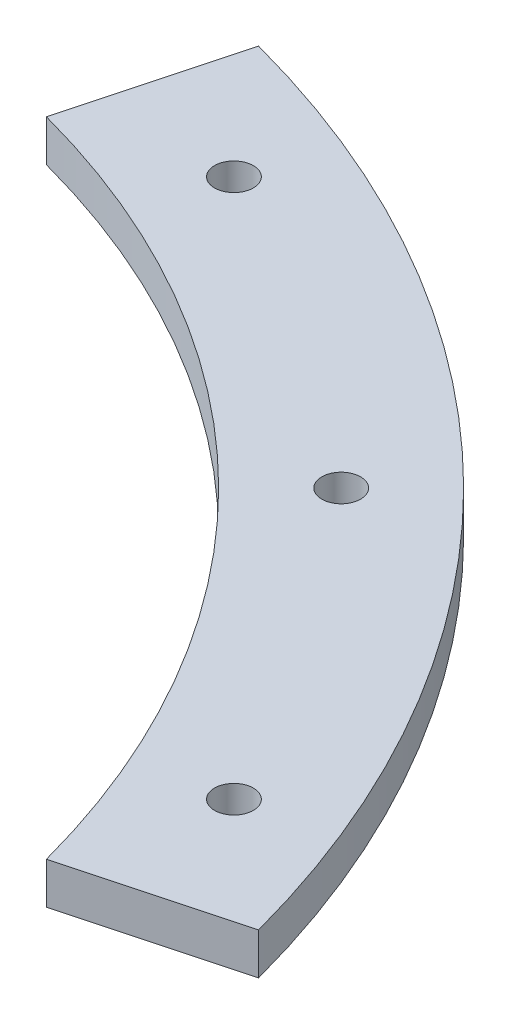
ISO-10303-21;
HEADER;
FILE_DESCRIPTION(('STEP AP214'),'2;1');
FILE_NAME('part.step','',(''),(''),'','','');
FILE_SCHEMA(('AUTOMOTIVE_DESIGN { 1 0 10303 214 1 1 1 1 }'));
ENDSEC;
DATA;
#1=APPLICATION_CONTEXT('core data for automotive mechanical design processes');
#2=APPLICATION_PROTOCOL_DEFINITION('international standard','automotive_design',2000,#1);
#3=PRODUCT_CONTEXT('',#1,'mechanical');
#4=PRODUCT('Part','Part','',(#3));
#5=PRODUCT_RELATED_PRODUCT_CATEGORY('part','',(#4));
#6=PRODUCT_DEFINITION_FORMATION('','',#4);
#7=PRODUCT_DEFINITION_CONTEXT('part definition',#1,'design');
#8=PRODUCT_DEFINITION('design','',#6,#7);
#9=PRODUCT_DEFINITION_SHAPE('','',#8);
#10=(LENGTH_UNIT() NAMED_UNIT(*) SI_UNIT(.MILLI.,.METRE.));
#11=(NAMED_UNIT(*) PLANE_ANGLE_UNIT() SI_UNIT($,.RADIAN.));
#12=(NAMED_UNIT(*) SI_UNIT($,.STERADIAN.) SOLID_ANGLE_UNIT());
#13=UNCERTAINTY_MEASURE_WITH_UNIT(LENGTH_MEASURE(1.E-05),#10,'distance_accuracy_value','');
#14=(GEOMETRIC_REPRESENTATION_CONTEXT(3) GLOBAL_UNCERTAINTY_ASSIGNED_CONTEXT((#13)) GLOBAL_UNIT_ASSIGNED_CONTEXT((#10,
#11,#12)) REPRESENTATION_CONTEXT('',''));
#15=CARTESIAN_POINT('',(0.,0.,0.));
#16=DIRECTION('',(0.,0.,1.));
#17=DIRECTION('',(1.,0.,0.));
#18=AXIS2_PLACEMENT_3D('',#15,#16,#17);
#19=CARTESIAN_POINT('',(0.,3.048,0.));
#20=DIRECTION('',(0.,-1.,0.));
#21=DIRECTION('',(0.,0.,-1.));
#22=AXIS2_PLACEMENT_3D('',#19,#20,#21);
#23=CYLINDRICAL_SURFACE('',#22,66.675);
#24=CARTESIAN_POINT('',(0.,0.,0.));
#25=DIRECTION('',(0.,1.,0.));
#26=DIRECTION('',(0.,0.,1.));
#27=AXIS2_PLACEMENT_3D('',#24,#25,#26);
#28=CIRCLE('',#27,66.675);
#29=CARTESIAN_POINT('',(64.4031044678236,0.,-17.2567598322105));
#30=VERTEX_POINT('',#29);
#31=CARTESIAN_POINT('',(17.2567598322109,0.,-64.4031044678235));
#32=VERTEX_POINT('',#31);
#33=EDGE_CURVE('E105',#30,#32,#28,.T.);
#34=ORIENTED_EDGE('',*,*,#33,.F.);
#35=DIRECTION('',(0.,-1.,0.));
#36=VECTOR('',#35,1.);
#37=CARTESIAN_POINT('',(64.4031044678236,3.048,-17.2567598322105));
#38=LINE('',#37,#36);
#39=CARTESIAN_POINT('',(64.4031044678236,3.048,-17.2567598322105));
#40=VERTEX_POINT('',#39);
#41=EDGE_CURVE('E11',#40,#30,#38,.T.);
#42=ORIENTED_EDGE('',*,*,#41,.F.);
#43=CARTESIAN_POINT('',(0.,3.048,0.));
#44=DIRECTION('',(0.,1.,0.));
#45=DIRECTION('',(0.,0.,1.));
#46=AXIS2_PLACEMENT_3D('',#43,#44,#45);
#47=CIRCLE('',#46,66.675);
#48=CARTESIAN_POINT('',(17.2567598322109,3.048,-64.4031044678235));
#49=VERTEX_POINT('',#48);
#50=EDGE_CURVE('E91',#40,#49,#47,.T.);
#51=ORIENTED_EDGE('',*,*,#50,.T.);
#52=DIRECTION('',(0.,-1.,0.));
#53=VECTOR('',#52,1.);
#54=CARTESIAN_POINT('',(17.2567598322109,3.048,-64.4031044678235));
#55=LINE('',#54,#53);
#56=EDGE_CURVE('E73',#49,#32,#55,.T.);
#57=ORIENTED_EDGE('',*,*,#56,.T.);
#58=EDGE_LOOP('',(#34,#42,#51,#57));
#59=FACE_BOUND('',#58,.T.);
#60=ADVANCED_FACE('F34',(#59),#23,.F.);
#61=CARTESIAN_POINT('',(0.,3.048,0.));
#62=DIRECTION('',(-0.25881904510252,0.,-0.965925826289069));
#63=DIRECTION('',(-0.965925826289069,0.,0.25881904510252));
#64=AXIS2_PLACEMENT_3D('',#61,#62,#63);
#65=PLANE('',#64);
#66=DIRECTION('',(0.965925826289069,0.,-0.25881904510252));
#67=VECTOR('',#66,1.);
#68=CARTESIAN_POINT('',(0.,0.,0.));
#69=LINE('',#68,#67);
#70=CARTESIAN_POINT('',(76.6703624616948,0.,-20.5437617050125));
#71=VERTEX_POINT('',#70);
#72=EDGE_CURVE('E96',#30,#71,#69,.T.);
#73=ORIENTED_EDGE('',*,*,#72,.T.);
#74=DIRECTION('',(0.,-1.,0.));
#75=VECTOR('',#74,1.);
#76=CARTESIAN_POINT('',(76.6703624616948,3.048,-20.5437617050125));
#77=LINE('',#76,#75);
#78=CARTESIAN_POINT('',(76.6703624616948,3.048,-20.5437617050125));
#79=VERTEX_POINT('',#78);
#80=EDGE_CURVE('E43',#79,#71,#77,.T.);
#81=ORIENTED_EDGE('',*,*,#80,.F.);
#82=DIRECTION('',(0.965925826289069,0.,-0.25881904510252));
#83=VECTOR('',#82,1.);
#84=CARTESIAN_POINT('',(0.,3.048,0.));
#85=LINE('',#84,#83);
#86=EDGE_CURVE('E88',#40,#79,#85,.T.);
#87=ORIENTED_EDGE('',*,*,#86,.F.);
#88=ORIENTED_EDGE('',*,*,#41,.T.);
#89=EDGE_LOOP('',(#73,#81,#87,#88));
#90=FACE_BOUND('',#89,.T.);
#91=ADVANCED_FACE('F94',(#90),#65,.F.);
#92=CARTESIAN_POINT('',(0.,3.048,0.));
#93=DIRECTION('',(0.,-1.,0.));
#94=DIRECTION('',(0.,0.,-1.));
#95=AXIS2_PLACEMENT_3D('',#92,#93,#94);
#96=CYLINDRICAL_SURFACE('',#95,79.375);
#97=CARTESIAN_POINT('',(0.,0.,0.));
#98=DIRECTION('',(0.,1.,0.));
#99=DIRECTION('',(0.,0.,1.));
#100=AXIS2_PLACEMENT_3D('',#97,#98,#99);
#101=CIRCLE('',#100,79.375);
#102=CARTESIAN_POINT('',(20.543761705013,0.,-76.6703624616947));
#103=VERTEX_POINT('',#102);
#104=EDGE_CURVE('E102',#71,#103,#101,.T.);
#105=ORIENTED_EDGE('',*,*,#104,.T.);
#106=DIRECTION('',(0.,-1.,0.));
#107=VECTOR('',#106,1.);
#108=CARTESIAN_POINT('',(20.543761705013,3.048,-76.6703624616947));
#109=LINE('',#108,#107);
#110=CARTESIAN_POINT('',(20.543761705013,3.048,-76.6703624616947));
#111=VERTEX_POINT('',#110);
#112=EDGE_CURVE('E87',#111,#103,#109,.T.);
#113=ORIENTED_EDGE('',*,*,#112,.F.);
#114=CARTESIAN_POINT('',(0.,3.048,0.));
#115=DIRECTION('',(0.,1.,0.));
#116=DIRECTION('',(0.,0.,1.));
#117=AXIS2_PLACEMENT_3D('',#114,#115,#116);
#118=CIRCLE('',#117,79.375);
#119=EDGE_CURVE('E81',#79,#111,#118,.T.);
#120=ORIENTED_EDGE('',*,*,#119,.F.);
#121=ORIENTED_EDGE('',*,*,#80,.T.);
#122=EDGE_LOOP('',(#105,#113,#120,#121));
#123=FACE_BOUND('',#122,.T.);
#124=ADVANCED_FACE('F84',(#123),#96,.T.);
#125=CARTESIAN_POINT('',(27.9454576484607,3.048,-67.4663028616367));
#126=DIRECTION('',(0.,-1.,0.));
#127=DIRECTION('',(0.,0.,-1.));
#128=AXIS2_PLACEMENT_3D('',#125,#126,#127);
#129=CYLINDRICAL_SURFACE('',#128,1.42240000000009);
#130=CARTESIAN_POINT('',(27.9454576484607,3.048,-67.4663028616367));
#131=DIRECTION('',(0.,1.,0.));
#132=DIRECTION('',(0.,0.,1.));
#133=AXIS2_PLACEMENT_3D('',#130,#131,#132);
#134=CIRCLE('',#133,1.42240000000009);
#135=CARTESIAN_POINT('',(27.9454576484607,3.048,-66.0439028616366));
#136=VERTEX_POINT('',#135);
#137=EDGE_CURVE('E118',#136,#136,#134,.T.);
#138=ORIENTED_EDGE('',*,*,#137,.T.);
#139=EDGE_LOOP('',(#138));
#140=FACE_BOUND('',#139,.T.);
#141=CARTESIAN_POINT('',(27.9454576484607,0.,-67.4663028616367));
#142=DIRECTION('',(0.,1.,0.));
#143=DIRECTION('',(0.,0.,1.));
#144=AXIS2_PLACEMENT_3D('',#141,#142,#143);
#145=CIRCLE('',#144,1.42240000000009);
#146=CARTESIAN_POINT('',(27.9454576484607,0.,-66.0439028616366));
#147=VERTEX_POINT('',#146);
#148=EDGE_CURVE('E107',#147,#147,#145,.T.);
#149=ORIENTED_EDGE('',*,*,#148,.F.);
#150=EDGE_LOOP('',(#149));
#151=FACE_BOUND('',#150,.T.);
#152=ADVANCED_FACE('F138',(#140,#151),#129,.F.);
#153=CARTESIAN_POINT('',(51.6364726961476,3.048,-51.6364726961476));
#154=DIRECTION('',(0.,-1.,0.));
#155=DIRECTION('',(0.,0.,-1.));
#156=AXIS2_PLACEMENT_3D('',#153,#154,#155);
#157=CYLINDRICAL_SURFACE('',#156,1.42240000000013);
#158=CARTESIAN_POINT('',(51.6364726961476,3.048,-51.6364726961476));
#159=DIRECTION('',(0.,1.,0.));
#160=DIRECTION('',(0.,0.,1.));
#161=AXIS2_PLACEMENT_3D('',#158,#159,#160);
#162=CIRCLE('',#161,1.42240000000013);
#163=CARTESIAN_POINT('',(51.6364726961476,3.048,-50.2140726961475));
#164=VERTEX_POINT('',#163);
#165=EDGE_CURVE('E121',#164,#164,#162,.T.);
#166=ORIENTED_EDGE('',*,*,#165,.T.);
#167=EDGE_LOOP('',(#166));
#168=FACE_BOUND('',#167,.T.);
#169=CARTESIAN_POINT('',(51.6364726961476,0.,-51.6364726961476));
#170=DIRECTION('',(0.,1.,0.));
#171=DIRECTION('',(0.,0.,1.));
#172=AXIS2_PLACEMENT_3D('',#169,#170,#171);
#173=CIRCLE('',#172,1.42240000000013);
#174=CARTESIAN_POINT('',(51.6364726961476,0.,-50.2140726961475));
#175=VERTEX_POINT('',#174);
#176=EDGE_CURVE('E110',#175,#175,#173,.T.);
#177=ORIENTED_EDGE('',*,*,#176,.F.);
#178=EDGE_LOOP('',(#177));
#179=FACE_BOUND('',#178,.T.);
#180=ADVANCED_FACE('F141',(#168,#179),#157,.F.);
#181=CARTESIAN_POINT('',(67.4663028616367,3.048,-27.9454576484607));
#182=DIRECTION('',(0.,-1.,0.));
#183=DIRECTION('',(0.,0.,-1.));
#184=AXIS2_PLACEMENT_3D('',#181,#182,#183);
#185=CYLINDRICAL_SURFACE('',#184,1.42240000000018);
#186=CARTESIAN_POINT('',(67.4663028616367,3.048,-27.9454576484607));
#187=DIRECTION('',(0.,1.,0.));
#188=DIRECTION('',(0.,0.,1.));
#189=AXIS2_PLACEMENT_3D('',#186,#187,#188);
#190=CIRCLE('',#189,1.42240000000018);
#191=CARTESIAN_POINT('',(67.4663028616367,3.048,-26.5230576484605));
#192=VERTEX_POINT('',#191);
#193=EDGE_CURVE('E101',#192,#192,#190,.T.);
#194=ORIENTED_EDGE('',*,*,#193,.T.);
#195=EDGE_LOOP('',(#194));
#196=FACE_BOUND('',#195,.T.);
#197=CARTESIAN_POINT('',(67.4663028616367,0.,-27.9454576484607));
#198=DIRECTION('',(0.,1.,0.));
#199=DIRECTION('',(0.,0.,1.));
#200=AXIS2_PLACEMENT_3D('',#197,#198,#199);
#201=CIRCLE('',#200,1.42240000000018);
#202=CARTESIAN_POINT('',(67.4663028616367,0.,-26.5230576484605));
#203=VERTEX_POINT('',#202);
#204=EDGE_CURVE('E113',#203,#203,#201,.T.);
#205=ORIENTED_EDGE('',*,*,#204,.F.);
#206=EDGE_LOOP('',(#205));
#207=FACE_BOUND('',#206,.T.);
#208=ADVANCED_FACE('F36',(#196,#207),#185,.F.);
#209=CARTESIAN_POINT('',(0.,3.048,0.));
#210=DIRECTION('',(0.965925826289067,0.,0.258819045102526));
#211=DIRECTION('',(0.258819045102526,0.,-0.965925826289067));
#212=AXIS2_PLACEMENT_3D('',#209,#210,#211);
#213=PLANE('',#212);
#214=DIRECTION('',(-0.258819045102526,0.,0.965925826289067));
#215=VECTOR('',#214,1.);
#216=CARTESIAN_POINT('',(0.,0.,0.));
#217=LINE('',#216,#215);
#218=EDGE_CURVE('E66',#103,#32,#217,.T.);
#219=ORIENTED_EDGE('',*,*,#218,.T.);
#220=ORIENTED_EDGE('',*,*,#56,.F.);
#221=DIRECTION('',(-0.258819045102526,0.,0.965925826289067));
#222=VECTOR('',#221,1.);
#223=CARTESIAN_POINT('',(0.,3.048,0.));
#224=LINE('',#223,#222);
#225=EDGE_CURVE('E51',#111,#49,#224,.T.);
#226=ORIENTED_EDGE('',*,*,#225,.F.);
#227=ORIENTED_EDGE('',*,*,#112,.T.);
#228=EDGE_LOOP('',(#219,#220,#226,#227));
#229=FACE_BOUND('',#228,.T.);
#230=ADVANCED_FACE('F132',(#229),#213,.F.);
#231=CARTESIAN_POINT('',(0.,3.048,0.));
#232=DIRECTION('',(0.,1.,0.));
#233=DIRECTION('',(0.,0.,1.));
#234=AXIS2_PLACEMENT_3D('',#231,#232,#233);
#235=PLANE('',#234);
#236=ORIENTED_EDGE('',*,*,#193,.F.);
#237=EDGE_LOOP('',(#236));
#238=FACE_BOUND('',#237,.T.);
#239=ORIENTED_EDGE('',*,*,#165,.F.);
#240=EDGE_LOOP('',(#239));
#241=FACE_BOUND('',#240,.T.);
#242=ORIENTED_EDGE('',*,*,#137,.F.);
#243=EDGE_LOOP('',(#242));
#244=FACE_BOUND('',#243,.T.);
#245=ORIENTED_EDGE('',*,*,#50,.F.);
#246=ORIENTED_EDGE('',*,*,#86,.T.);
#247=ORIENTED_EDGE('',*,*,#119,.T.);
#248=ORIENTED_EDGE('',*,*,#225,.T.);
#249=EDGE_LOOP('',(#245,#246,#247,#248));
#250=FACE_BOUND('',#249,.T.);
#251=ADVANCED_FACE('F90',(#238,#241,#244,#250),#235,.T.);
#252=CARTESIAN_POINT('',(0.,0.,0.));
#253=DIRECTION('',(0.,1.,0.));
#254=DIRECTION('',(0.,0.,1.));
#255=AXIS2_PLACEMENT_3D('',#252,#253,#254);
#256=PLANE('',#255);
#257=ORIENTED_EDGE('',*,*,#204,.T.);
#258=EDGE_LOOP('',(#257));
#259=FACE_BOUND('',#258,.T.);
#260=ORIENTED_EDGE('',*,*,#176,.T.);
#261=EDGE_LOOP('',(#260));
#262=FACE_BOUND('',#261,.T.);
#263=ORIENTED_EDGE('',*,*,#148,.T.);
#264=EDGE_LOOP('',(#263));
#265=FACE_BOUND('',#264,.T.);
#266=ORIENTED_EDGE('',*,*,#33,.T.);
#267=ORIENTED_EDGE('',*,*,#218,.F.);
#268=ORIENTED_EDGE('',*,*,#104,.F.);
#269=ORIENTED_EDGE('',*,*,#72,.F.);
#270=EDGE_LOOP('',(#266,#267,#268,#269));
#271=FACE_BOUND('',#270,.T.);
#272=ADVANCED_FACE('F131',(#259,#262,#265,#271),#256,.F.);
#273=CLOSED_SHELL('',(#60,#91,#124,#152,#180,#208,#230,#251,#272));
#274=MANIFOLD_SOLID_BREP('B2',#273);
#275=ADVANCED_BREP_SHAPE_REPRESENTATION('',(#18,#274),#14);
#276=SHAPE_DEFINITION_REPRESENTATION(#9,#275);
ENDSEC;
END-ISO-10303-21;
